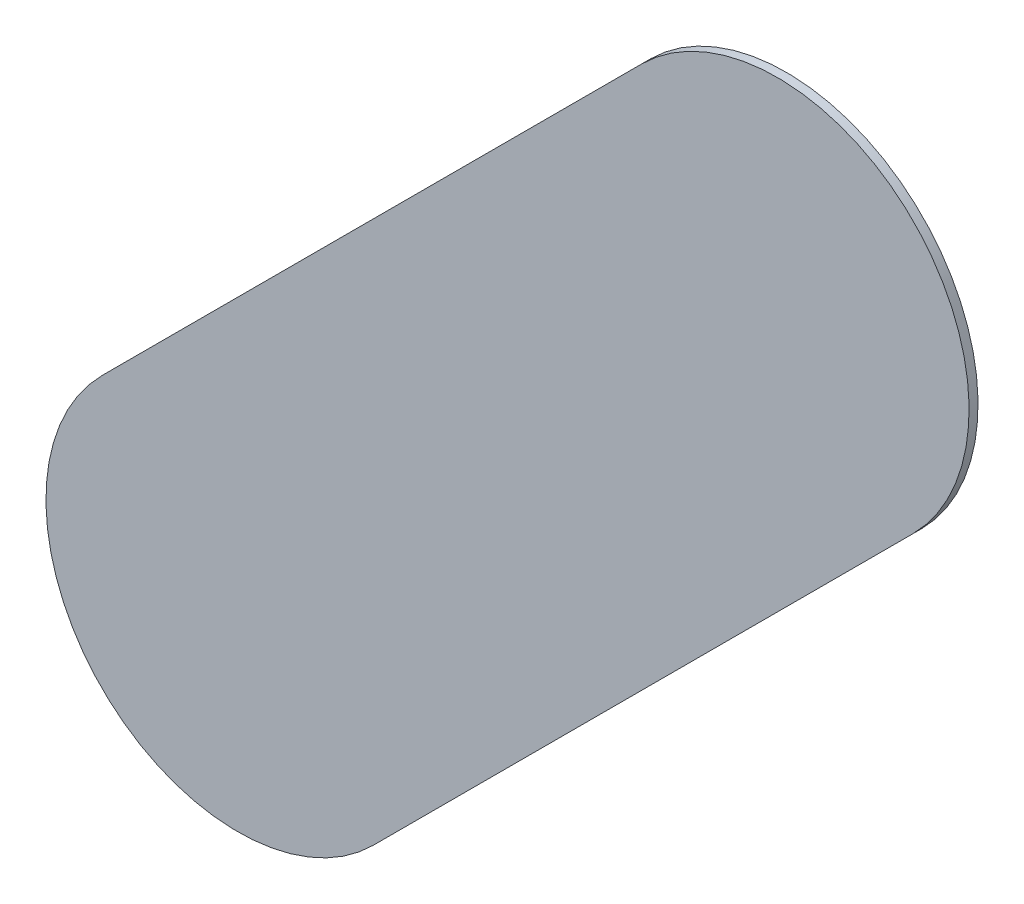
ISO-10303-21;
HEADER;
FILE_DESCRIPTION(('STEP AP214'),'2;1');
FILE_NAME('part.step','',(''),(''),'','','');
FILE_SCHEMA(('AUTOMOTIVE_DESIGN { 1 0 10303 214 1 1 1 1 }'));
ENDSEC;
DATA;
#1=APPLICATION_CONTEXT('core data for automotive mechanical design processes');
#2=APPLICATION_PROTOCOL_DEFINITION('international standard','automotive_design',2000,#1);
#3=PRODUCT_CONTEXT('',#1,'mechanical');
#4=PRODUCT('Part','Part','',(#3));
#5=PRODUCT_RELATED_PRODUCT_CATEGORY('part','',(#4));
#6=PRODUCT_DEFINITION_FORMATION('','',#4);
#7=PRODUCT_DEFINITION_CONTEXT('part definition',#1,'design');
#8=PRODUCT_DEFINITION('design','',#6,#7);
#9=PRODUCT_DEFINITION_SHAPE('','',#8);
#10=(LENGTH_UNIT() NAMED_UNIT(*) SI_UNIT(.MILLI.,.METRE.));
#11=(NAMED_UNIT(*) PLANE_ANGLE_UNIT() SI_UNIT($,.RADIAN.));
#12=(NAMED_UNIT(*) SI_UNIT($,.STERADIAN.) SOLID_ANGLE_UNIT());
#13=UNCERTAINTY_MEASURE_WITH_UNIT(LENGTH_MEASURE(1.E-05),#10,'distance_accuracy_value','');
#14=(GEOMETRIC_REPRESENTATION_CONTEXT(3) GLOBAL_UNCERTAINTY_ASSIGNED_CONTEXT((#13)) GLOBAL_UNIT_ASSIGNED_CONTEXT((#10,
#11,#12)) REPRESENTATION_CONTEXT('',''));
#15=CARTESIAN_POINT('',(0.,0.,0.));
#16=DIRECTION('',(0.,0.,1.));
#17=DIRECTION('',(1.,0.,0.));
#18=AXIS2_PLACEMENT_3D('',#15,#16,#17);
#19=CARTESIAN_POINT('',(153.471669,-116.739669,0.));
#20=DIRECTION('',(0.,0.,1.));
#21=DIRECTION('',(1.,0.,0.));
#22=AXIS2_PLACEMENT_3D('',#19,#20,#21);
#23=PLANE('',#22);
#24=DIRECTION('',(-0.707106781186548,-0.707106781186548,0.));
#25=VECTOR('',#24,1.);
#26=CARTESIAN_POINT('',(153.471669,-116.739669,0.));
#27=LINE('',#26,#25);
#28=CARTESIAN_POINT('',(153.471669,-116.739669,0.));
#29=VERTEX_POINT('',#28);
#30=CARTESIAN_POINT('',(151.361669,-118.849669,0.));
#31=VERTEX_POINT('',#30);
#32=EDGE_CURVE('E85',#29,#31,#27,.T.);
#33=ORIENTED_EDGE('',*,*,#32,.T.);
#34=CARTESIAN_POINT('',(151.8919995,-119.3799995,0.));
#35=DIRECTION('',(0.,0.,1.));
#36=DIRECTION('',(-0.707106781186548,0.707106781186548,0.));
#37=AXIS2_PLACEMENT_3D('',#34,#35,#36);
#38=CIRCLE('',#37,0.75000058564);
#39=CARTESIAN_POINT('',(152.42233,-119.91033,0.));
#40=VERTEX_POINT('',#39);
#41=EDGE_CURVE('E71',#31,#40,#38,.T.);
#42=ORIENTED_EDGE('',*,*,#41,.T.);
#43=DIRECTION('',(0.707106781186548,0.707106781186548,0.));
#44=VECTOR('',#43,1.);
#45=CARTESIAN_POINT('',(152.42233,-119.91033,0.));
#46=LINE('',#45,#44);
#47=CARTESIAN_POINT('',(154.53233,-117.80033,0.));
#48=VERTEX_POINT('',#47);
#49=EDGE_CURVE('E114',#40,#48,#46,.T.);
#50=ORIENTED_EDGE('',*,*,#49,.T.);
#51=CARTESIAN_POINT('',(154.0019995,-117.2699995,0.));
#52=DIRECTION('',(0.,0.,1.));
#53=DIRECTION('',(0.707106781186548,-0.707106781186548,0.));
#54=AXIS2_PLACEMENT_3D('',#51,#52,#53);
#55=CIRCLE('',#54,0.75000058564);
#56=EDGE_CURVE('E11',#48,#29,#55,.T.);
#57=ORIENTED_EDGE('',*,*,#56,.T.);
#58=EDGE_LOOP('',(#33,#42,#50,#57));
#59=FACE_BOUND('',#58,.T.);
#60=ADVANCED_FACE('F17',(#59),#23,.T.);
#61=CARTESIAN_POINT('',(153.471669,-116.739669,-0.035));
#62=DIRECTION('',(0.,0.,1.));
#63=DIRECTION('',(1.,0.,0.));
#64=AXIS2_PLACEMENT_3D('',#61,#62,#63);
#65=PLANE('',#64);
#66=CARTESIAN_POINT('',(154.0019995,-117.2699995,-0.035));
#67=DIRECTION('',(0.,0.,1.));
#68=DIRECTION('',(0.707106781186548,-0.707106781186548,0.));
#69=AXIS2_PLACEMENT_3D('',#66,#67,#68);
#70=CIRCLE('',#69,0.75000058564);
#71=CARTESIAN_POINT('',(154.53233,-117.80033,-0.035));
#72=VERTEX_POINT('',#71);
#73=CARTESIAN_POINT('',(153.471669,-116.739669,-0.035));
#74=VERTEX_POINT('',#73);
#75=EDGE_CURVE('E20',#72,#74,#70,.T.);
#76=ORIENTED_EDGE('',*,*,#75,.F.);
#77=DIRECTION('',(0.707106781186548,0.707106781186548,0.));
#78=VECTOR('',#77,1.);
#79=CARTESIAN_POINT('',(152.42233,-119.91033,-0.035));
#80=LINE('',#79,#78);
#81=CARTESIAN_POINT('',(152.42233,-119.91033,-0.035));
#82=VERTEX_POINT('',#81);
#83=EDGE_CURVE('E82',#82,#72,#80,.T.);
#84=ORIENTED_EDGE('',*,*,#83,.F.);
#85=CARTESIAN_POINT('',(151.8919995,-119.3799995,-0.035));
#86=DIRECTION('',(0.,0.,1.));
#87=DIRECTION('',(-0.707106781186548,0.707106781186548,0.));
#88=AXIS2_PLACEMENT_3D('',#85,#86,#87);
#89=CIRCLE('',#88,0.75000058564);
#90=CARTESIAN_POINT('',(151.361669,-118.849669,-0.035));
#91=VERTEX_POINT('',#90);
#92=EDGE_CURVE('E103',#91,#82,#89,.T.);
#93=ORIENTED_EDGE('',*,*,#92,.F.);
#94=DIRECTION('',(-0.707106781186548,-0.707106781186548,0.));
#95=VECTOR('',#94,1.);
#96=CARTESIAN_POINT('',(153.471669,-116.739669,-0.035));
#97=LINE('',#96,#95);
#98=EDGE_CURVE('E92',#74,#91,#97,.T.);
#99=ORIENTED_EDGE('',*,*,#98,.F.);
#100=EDGE_LOOP('',(#76,#84,#93,#99));
#101=FACE_BOUND('',#100,.T.);
#102=ADVANCED_FACE('F122',(#101),#65,.F.);
#103=CARTESIAN_POINT('',(154.0019995,-117.2699995,-0.035));
#104=DIRECTION('',(0.,0.,-1.));
#105=DIRECTION('',(0.707106781186548,-0.707106781186548,0.));
#106=AXIS2_PLACEMENT_3D('',#103,#104,#105);
#107=CYLINDRICAL_SURFACE('',#106,0.75000058564);
#108=ORIENTED_EDGE('',*,*,#75,.T.);
#109=DIRECTION('',(0.,0.,1.));
#110=VECTOR('',#109,1.);
#111=CARTESIAN_POINT('',(153.471669,-116.739669,-0.035));
#112=LINE('',#111,#110);
#113=EDGE_CURVE('E89',#74,#29,#112,.T.);
#114=ORIENTED_EDGE('',*,*,#113,.T.);
#115=ORIENTED_EDGE('',*,*,#56,.F.);
#116=DIRECTION('',(0.,0.,1.));
#117=VECTOR('',#116,1.);
#118=CARTESIAN_POINT('',(154.53233,-117.80033,-0.035));
#119=LINE('',#118,#117);
#120=EDGE_CURVE('E111',#72,#48,#119,.T.);
#121=ORIENTED_EDGE('',*,*,#120,.F.);
#122=EDGE_LOOP('',(#108,#114,#115,#121));
#123=FACE_BOUND('',#122,.T.);
#124=ADVANCED_FACE('F121',(#123),#107,.T.);
#125=CARTESIAN_POINT('',(152.42233,-119.91033,-0.035));
#126=DIRECTION('',(-0.707106781186548,0.707106781186548,0.));
#127=DIRECTION('',(0.,0.,1.));
#128=AXIS2_PLACEMENT_3D('',#125,#126,#127);
#129=PLANE('',#128);
#130=ORIENTED_EDGE('',*,*,#83,.T.);
#131=ORIENTED_EDGE('',*,*,#120,.T.);
#132=ORIENTED_EDGE('',*,*,#49,.F.);
#133=DIRECTION('',(0.,0.,1.));
#134=VECTOR('',#133,1.);
#135=CARTESIAN_POINT('',(152.42233,-119.91033,-0.035));
#136=LINE('',#135,#134);
#137=EDGE_CURVE('E79',#82,#40,#136,.T.);
#138=ORIENTED_EDGE('',*,*,#137,.F.);
#139=EDGE_LOOP('',(#130,#131,#132,#138));
#140=FACE_BOUND('',#139,.T.);
#141=ADVANCED_FACE('F124',(#140),#129,.F.);
#142=CARTESIAN_POINT('',(151.8919995,-119.3799995,-0.035));
#143=DIRECTION('',(0.,0.,-1.));
#144=DIRECTION('',(-0.707106781186548,0.707106781186548,0.));
#145=AXIS2_PLACEMENT_3D('',#142,#143,#144);
#146=CYLINDRICAL_SURFACE('',#145,0.75000058564);
#147=ORIENTED_EDGE('',*,*,#92,.T.);
#148=ORIENTED_EDGE('',*,*,#137,.T.);
#149=ORIENTED_EDGE('',*,*,#41,.F.);
#150=DIRECTION('',(0.,0.,1.));
#151=VECTOR('',#150,1.);
#152=CARTESIAN_POINT('',(151.361669,-118.849669,-0.035));
#153=LINE('',#152,#151);
#154=EDGE_CURVE('E76',#91,#31,#153,.T.);
#155=ORIENTED_EDGE('',*,*,#154,.F.);
#156=EDGE_LOOP('',(#147,#148,#149,#155));
#157=FACE_BOUND('',#156,.T.);
#158=ADVANCED_FACE('F74',(#157),#146,.T.);
#159=CARTESIAN_POINT('',(153.471669,-116.739669,-0.035));
#160=DIRECTION('',(0.707106781186548,-0.707106781186548,0.));
#161=DIRECTION('',(0.,0.,-1.));
#162=AXIS2_PLACEMENT_3D('',#159,#160,#161);
#163=PLANE('',#162);
#164=ORIENTED_EDGE('',*,*,#98,.T.);
#165=ORIENTED_EDGE('',*,*,#154,.T.);
#166=ORIENTED_EDGE('',*,*,#32,.F.);
#167=ORIENTED_EDGE('',*,*,#113,.F.);
#168=EDGE_LOOP('',(#164,#165,#166,#167));
#169=FACE_BOUND('',#168,.T.);
#170=ADVANCED_FACE('F91',(#169),#163,.F.);
#171=CLOSED_SHELL('',(#60,#102,#124,#141,#158,#170));
#172=MANIFOLD_SOLID_BREP('B1',#171);
#173=ADVANCED_BREP_SHAPE_REPRESENTATION('',(#18,#172),#14);
#174=SHAPE_DEFINITION_REPRESENTATION(#9,#173);
ENDSEC;
END-ISO-10303-21;
